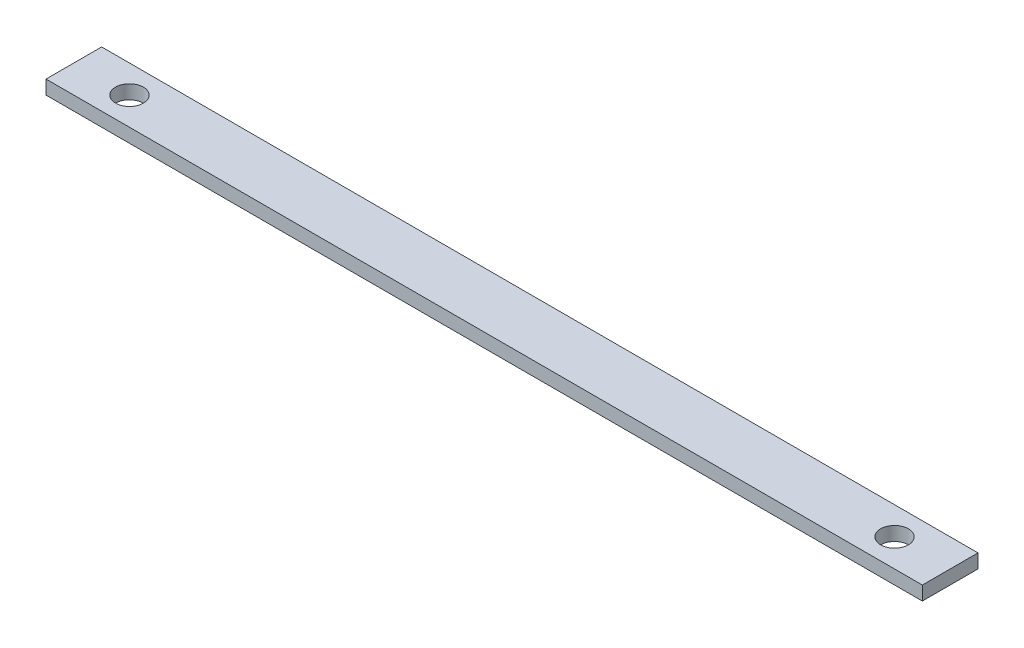
ISO-10303-21;
HEADER;
FILE_DESCRIPTION(('STEP AP214'),'2;1');
FILE_NAME('part.step','',(''),(''),'','','');
FILE_SCHEMA(('AUTOMOTIVE_DESIGN { 1 0 10303 214 1 1 1 1 }'));
ENDSEC;
DATA;
#1=APPLICATION_CONTEXT('core data for automotive mechanical design processes');
#2=APPLICATION_PROTOCOL_DEFINITION('international standard','automotive_design',2000,#1);
#3=PRODUCT_CONTEXT('',#1,'mechanical');
#4=PRODUCT('Part','Part','',(#3));
#5=PRODUCT_RELATED_PRODUCT_CATEGORY('part','',(#4));
#6=PRODUCT_DEFINITION_FORMATION('','',#4);
#7=PRODUCT_DEFINITION_CONTEXT('part definition',#1,'design');
#8=PRODUCT_DEFINITION('design','',#6,#7);
#9=PRODUCT_DEFINITION_SHAPE('','',#8);
#10=(LENGTH_UNIT() NAMED_UNIT(*) SI_UNIT(.MILLI.,.METRE.));
#11=(NAMED_UNIT(*) PLANE_ANGLE_UNIT() SI_UNIT($,.RADIAN.));
#12=(NAMED_UNIT(*) SI_UNIT($,.STERADIAN.) SOLID_ANGLE_UNIT());
#13=UNCERTAINTY_MEASURE_WITH_UNIT(LENGTH_MEASURE(1.E-05),#10,'distance_accuracy_value','');
#14=(GEOMETRIC_REPRESENTATION_CONTEXT(3) GLOBAL_UNCERTAINTY_ASSIGNED_CONTEXT((#13)) GLOBAL_UNIT_ASSIGNED_CONTEXT((#10,
#11,#12)) REPRESENTATION_CONTEXT('',''));
#15=CARTESIAN_POINT('',(0.,0.,0.));
#16=DIRECTION('',(0.,0.,1.));
#17=DIRECTION('',(1.,0.,0.));
#18=AXIS2_PLACEMENT_3D('',#15,#16,#17);
#19=CARTESIAN_POINT('',(0.,3.175,0.));
#20=DIRECTION('',(1.,0.,0.));
#21=DIRECTION('',(0.,0.,-1.));
#22=AXIS2_PLACEMENT_3D('',#19,#20,#21);
#23=PLANE('',#22);
#24=DIRECTION('',(0.,0.,1.));
#25=VECTOR('',#24,1.);
#26=CARTESIAN_POINT('',(0.,0.,0.));
#27=LINE('',#26,#25);
#28=CARTESIAN_POINT('',(0.,0.,-12.7));
#29=VERTEX_POINT('',#28);
#30=CARTESIAN_POINT('',(0.,0.,0.));
#31=VERTEX_POINT('',#30);
#32=EDGE_CURVE('E107',#29,#31,#27,.T.);
#33=ORIENTED_EDGE('',*,*,#32,.T.);
#34=DIRECTION('',(0.,-1.,0.));
#35=VECTOR('',#34,1.);
#36=CARTESIAN_POINT('',(0.,3.175,0.));
#37=LINE('',#36,#35);
#38=CARTESIAN_POINT('',(0.,3.175,0.));
#39=VERTEX_POINT('',#38);
#40=EDGE_CURVE('E11',#39,#31,#37,.T.);
#41=ORIENTED_EDGE('',*,*,#40,.F.);
#42=DIRECTION('',(0.,0.,1.));
#43=VECTOR('',#42,1.);
#44=CARTESIAN_POINT('',(0.,3.175,0.));
#45=LINE('',#44,#43);
#46=CARTESIAN_POINT('',(0.,3.175,-12.7));
#47=VERTEX_POINT('',#46);
#48=EDGE_CURVE('E91',#47,#39,#45,.T.);
#49=ORIENTED_EDGE('',*,*,#48,.F.);
#50=DIRECTION('',(0.,-1.,0.));
#51=VECTOR('',#50,1.);
#52=CARTESIAN_POINT('',(0.,3.175,-12.7));
#53=LINE('',#52,#51);
#54=EDGE_CURVE('E103',#47,#29,#53,.T.);
#55=ORIENTED_EDGE('',*,*,#54,.T.);
#56=EDGE_LOOP('',(#33,#41,#49,#55));
#57=FACE_BOUND('',#56,.T.);
#58=ADVANCED_FACE('F39',(#57),#23,.F.);
#59=CARTESIAN_POINT('',(0.,3.175,0.));
#60=DIRECTION('',(0.,0.,-1.));
#61=DIRECTION('',(-1.,0.,0.));
#62=AXIS2_PLACEMENT_3D('',#59,#60,#61);
#63=PLANE('',#62);
#64=DIRECTION('',(1.,0.,0.));
#65=VECTOR('',#64,1.);
#66=CARTESIAN_POINT('',(0.,0.,0.));
#67=LINE('',#66,#65);
#68=CARTESIAN_POINT('',(200.,0.,0.));
#69=VERTEX_POINT('',#68);
#70=EDGE_CURVE('E96',#31,#69,#67,.T.);
#71=ORIENTED_EDGE('',*,*,#70,.T.);
#72=DIRECTION('',(0.,-1.,0.));
#73=VECTOR('',#72,1.);
#74=CARTESIAN_POINT('',(200.,3.175,0.));
#75=LINE('',#74,#73);
#76=CARTESIAN_POINT('',(200.,3.175,0.));
#77=VERTEX_POINT('',#76);
#78=EDGE_CURVE('E48',#77,#69,#75,.T.);
#79=ORIENTED_EDGE('',*,*,#78,.F.);
#80=DIRECTION('',(1.,0.,0.));
#81=VECTOR('',#80,1.);
#82=CARTESIAN_POINT('',(0.,3.175,0.));
#83=LINE('',#82,#81);
#84=EDGE_CURVE('E86',#39,#77,#83,.T.);
#85=ORIENTED_EDGE('',*,*,#84,.F.);
#86=ORIENTED_EDGE('',*,*,#40,.T.);
#87=EDGE_LOOP('',(#71,#79,#85,#86));
#88=FACE_BOUND('',#87,.T.);
#89=ADVANCED_FACE('F95',(#88),#63,.F.);
#90=CARTESIAN_POINT('',(200.,3.175,0.));
#91=DIRECTION('',(-1.,0.,0.));
#92=DIRECTION('',(0.,0.,1.));
#93=AXIS2_PLACEMENT_3D('',#90,#91,#92);
#94=PLANE('',#93);
#95=DIRECTION('',(0.,0.,-1.));
#96=VECTOR('',#95,1.);
#97=CARTESIAN_POINT('',(200.,0.,0.));
#98=LINE('',#97,#96);
#99=CARTESIAN_POINT('',(200.,0.,-12.7));
#100=VERTEX_POINT('',#99);
#101=EDGE_CURVE('E73',#69,#100,#98,.T.);
#102=ORIENTED_EDGE('',*,*,#101,.T.);
#103=DIRECTION('',(0.,-1.,0.));
#104=VECTOR('',#103,1.);
#105=CARTESIAN_POINT('',(200.,3.175,-12.7));
#106=LINE('',#105,#104);
#107=CARTESIAN_POINT('',(200.,3.175,-12.7));
#108=VERTEX_POINT('',#107);
#109=EDGE_CURVE('E98',#108,#100,#106,.T.);
#110=ORIENTED_EDGE('',*,*,#109,.F.);
#111=DIRECTION('',(0.,0.,-1.));
#112=VECTOR('',#111,1.);
#113=CARTESIAN_POINT('',(200.,3.175,0.));
#114=LINE('',#113,#112);
#115=EDGE_CURVE('E89',#77,#108,#114,.T.);
#116=ORIENTED_EDGE('',*,*,#115,.F.);
#117=ORIENTED_EDGE('',*,*,#78,.T.);
#118=EDGE_LOOP('',(#102,#110,#116,#117));
#119=FACE_BOUND('',#118,.T.);
#120=ADVANCED_FACE('F99',(#119),#94,.F.);
#121=CARTESIAN_POINT('',(0.,3.175,-12.7));
#122=DIRECTION('',(0.,0.,1.));
#123=DIRECTION('',(1.,0.,0.));
#124=AXIS2_PLACEMENT_3D('',#121,#122,#123);
#125=PLANE('',#124);
#126=DIRECTION('',(-1.,0.,0.));
#127=VECTOR('',#126,1.);
#128=CARTESIAN_POINT('',(0.,0.,-12.7));
#129=LINE('',#128,#127);
#130=EDGE_CURVE('E79',#100,#29,#129,.T.);
#131=ORIENTED_EDGE('',*,*,#130,.T.);
#132=ORIENTED_EDGE('',*,*,#54,.F.);
#133=DIRECTION('',(-1.,0.,0.));
#134=VECTOR('',#133,1.);
#135=CARTESIAN_POINT('',(0.,3.175,-12.7));
#136=LINE('',#135,#134);
#137=EDGE_CURVE('E56',#108,#47,#136,.T.);
#138=ORIENTED_EDGE('',*,*,#137,.F.);
#139=ORIENTED_EDGE('',*,*,#109,.T.);
#140=EDGE_LOOP('',(#131,#132,#138,#139));
#141=FACE_BOUND('',#140,.T.);
#142=ADVANCED_FACE('F121',(#141),#125,.F.);
#143=CARTESIAN_POINT('',(0.,3.175,0.));
#144=DIRECTION('',(0.,-1.,0.));
#145=DIRECTION('',(0.,0.,-1.));
#146=AXIS2_PLACEMENT_3D('',#143,#144,#145);
#147=PLANE('',#146);
#148=CARTESIAN_POINT('',(12.7,3.175,-6.35));
#149=DIRECTION('',(0.,1.,0.));
#150=DIRECTION('',(0.,0.,1.));
#151=AXIS2_PLACEMENT_3D('',#148,#149,#150);
#152=CIRCLE('',#151,3.175);
#153=CARTESIAN_POINT('',(12.7,3.175,-3.175));
#154=VERTEX_POINT('',#153);
#155=EDGE_CURVE('E136',#154,#154,#152,.T.);
#156=ORIENTED_EDGE('',*,*,#155,.F.);
#157=EDGE_LOOP('',(#156));
#158=FACE_BOUND('',#157,.T.);
#159=CARTESIAN_POINT('',(187.3,3.175,-6.35));
#160=DIRECTION('',(0.,1.,0.));
#161=DIRECTION('',(0.,0.,1.));
#162=AXIS2_PLACEMENT_3D('',#159,#160,#161);
#163=CIRCLE('',#162,3.175);
#164=CARTESIAN_POINT('',(187.3,3.175,-3.175));
#165=VERTEX_POINT('',#164);
#166=EDGE_CURVE('E128',#165,#165,#163,.T.);
#167=ORIENTED_EDGE('',*,*,#166,.F.);
#168=EDGE_LOOP('',(#167));
#169=FACE_BOUND('',#168,.T.);
#170=ORIENTED_EDGE('',*,*,#48,.T.);
#171=ORIENTED_EDGE('',*,*,#84,.T.);
#172=ORIENTED_EDGE('',*,*,#115,.T.);
#173=ORIENTED_EDGE('',*,*,#137,.T.);
#174=EDGE_LOOP('',(#170,#171,#172,#173));
#175=FACE_BOUND('',#174,.T.);
#176=ADVANCED_FACE('F87',(#158,#169,#175),#147,.F.);
#177=CARTESIAN_POINT('',(0.,0.,0.));
#178=DIRECTION('',(0.,-1.,0.));
#179=DIRECTION('',(0.,0.,-1.));
#180=AXIS2_PLACEMENT_3D('',#177,#178,#179);
#181=PLANE('',#180);
#182=CARTESIAN_POINT('',(12.7,0.,-6.35));
#183=DIRECTION('',(0.,1.,0.));
#184=DIRECTION('',(0.,0.,1.));
#185=AXIS2_PLACEMENT_3D('',#182,#183,#184);
#186=CIRCLE('',#185,3.175);
#187=CARTESIAN_POINT('',(12.7,0.,-3.175));
#188=VERTEX_POINT('',#187);
#189=EDGE_CURVE('E111',#188,#188,#186,.T.);
#190=ORIENTED_EDGE('',*,*,#189,.T.);
#191=EDGE_LOOP('',(#190));
#192=FACE_BOUND('',#191,.T.);
#193=CARTESIAN_POINT('',(187.3,0.,-6.35));
#194=DIRECTION('',(0.,1.,0.));
#195=DIRECTION('',(0.,0.,1.));
#196=AXIS2_PLACEMENT_3D('',#193,#194,#195);
#197=CIRCLE('',#196,3.175);
#198=CARTESIAN_POINT('',(187.3,0.,-3.175));
#199=VERTEX_POINT('',#198);
#200=EDGE_CURVE('E132',#199,#199,#197,.T.);
#201=ORIENTED_EDGE('',*,*,#200,.T.);
#202=EDGE_LOOP('',(#201));
#203=FACE_BOUND('',#202,.T.);
#204=ORIENTED_EDGE('',*,*,#32,.F.);
#205=ORIENTED_EDGE('',*,*,#130,.F.);
#206=ORIENTED_EDGE('',*,*,#101,.F.);
#207=ORIENTED_EDGE('',*,*,#70,.F.);
#208=EDGE_LOOP('',(#204,#205,#206,#207));
#209=FACE_BOUND('',#208,.T.);
#210=ADVANCED_FACE('F124',(#192,#203,#209),#181,.T.);
#211=CARTESIAN_POINT('',(187.3,0.,-6.35));
#212=DIRECTION('',(0.,1.,0.));
#213=DIRECTION('',(0.,0.,1.));
#214=AXIS2_PLACEMENT_3D('',#211,#212,#213);
#215=CYLINDRICAL_SURFACE('',#214,3.175);
#216=ORIENTED_EDGE('',*,*,#200,.F.);
#217=EDGE_LOOP('',(#216));
#218=FACE_BOUND('',#217,.T.);
#219=ORIENTED_EDGE('',*,*,#166,.T.);
#220=EDGE_LOOP('',(#219));
#221=FACE_BOUND('',#220,.T.);
#222=ADVANCED_FACE('F149',(#218,#221),#215,.F.);
#223=CARTESIAN_POINT('',(12.7,0.,-6.35));
#224=DIRECTION('',(0.,1.,0.));
#225=DIRECTION('',(0.,0.,1.));
#226=AXIS2_PLACEMENT_3D('',#223,#224,#225);
#227=CYLINDRICAL_SURFACE('',#226,3.175);
#228=ORIENTED_EDGE('',*,*,#189,.F.);
#229=EDGE_LOOP('',(#228));
#230=FACE_BOUND('',#229,.T.);
#231=ORIENTED_EDGE('',*,*,#155,.T.);
#232=EDGE_LOOP('',(#231));
#233=FACE_BOUND('',#232,.T.);
#234=ADVANCED_FACE('F146',(#230,#233),#227,.F.);
#235=CLOSED_SHELL('',(#58,#89,#120,#142,#176,#210,#222,#234));
#236=MANIFOLD_SOLID_BREP('B2',#235);
#237=ADVANCED_BREP_SHAPE_REPRESENTATION('',(#18,#236),#14);
#238=SHAPE_DEFINITION_REPRESENTATION(#9,#237);
ENDSEC;
END-ISO-10303-21;
